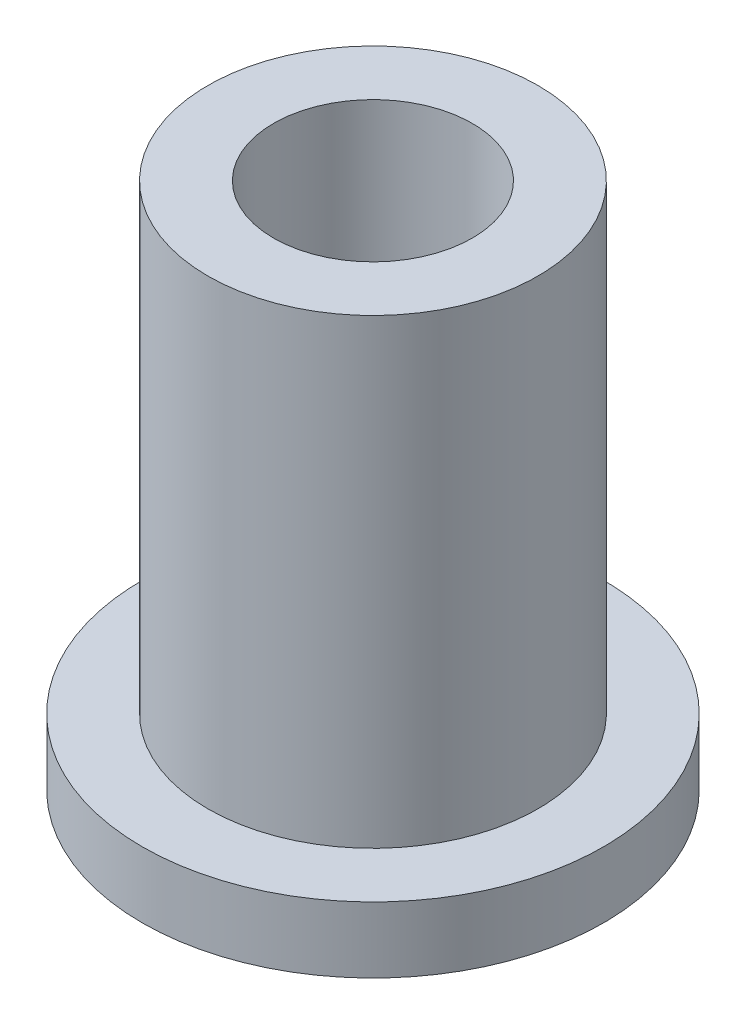
ISO-10303-21;
HEADER;
FILE_DESCRIPTION(('STEP AP214'),'2;1');
FILE_NAME('part.step','',(''),(''),'','','');
FILE_SCHEMA(('AUTOMOTIVE_DESIGN { 1 0 10303 214 1 1 1 1 }'));
ENDSEC;
DATA;
#1=APPLICATION_CONTEXT('core data for automotive mechanical design processes');
#2=APPLICATION_PROTOCOL_DEFINITION('international standard','automotive_design',2000,#1);
#3=PRODUCT_CONTEXT('',#1,'mechanical');
#4=PRODUCT('Part','Part','',(#3));
#5=PRODUCT_RELATED_PRODUCT_CATEGORY('part','',(#4));
#6=PRODUCT_DEFINITION_FORMATION('','',#4);
#7=PRODUCT_DEFINITION_CONTEXT('part definition',#1,'design');
#8=PRODUCT_DEFINITION('design','',#6,#7);
#9=PRODUCT_DEFINITION_SHAPE('','',#8);
#10=(LENGTH_UNIT() NAMED_UNIT(*) SI_UNIT(.MILLI.,.METRE.));
#11=(NAMED_UNIT(*) PLANE_ANGLE_UNIT() SI_UNIT($,.RADIAN.));
#12=(NAMED_UNIT(*) SI_UNIT($,.STERADIAN.) SOLID_ANGLE_UNIT());
#13=UNCERTAINTY_MEASURE_WITH_UNIT(LENGTH_MEASURE(1.E-05),#10,'distance_accuracy_value','');
#14=(GEOMETRIC_REPRESENTATION_CONTEXT(3) GLOBAL_UNCERTAINTY_ASSIGNED_CONTEXT((#13)) GLOBAL_UNIT_ASSIGNED_CONTEXT((#10,
#11,#12)) REPRESENTATION_CONTEXT('',''));
#15=CARTESIAN_POINT('',(0.,0.,0.));
#16=DIRECTION('',(0.,0.,1.));
#17=DIRECTION('',(1.,0.,0.));
#18=AXIS2_PLACEMENT_3D('',#15,#16,#17);
#19=CARTESIAN_POINT('',(0.,12.7,0.));
#20=DIRECTION('',(0.,1.,0.));
#21=DIRECTION('',(0.,0.,1.));
#22=AXIS2_PLACEMENT_3D('',#19,#20,#21);
#23=PLANE('',#22);
#24=CARTESIAN_POINT('',(0.,12.7,0.));
#25=DIRECTION('',(0.,1.,0.));
#26=DIRECTION('',(0.,0.,1.));
#27=AXIS2_PLACEMENT_3D('',#24,#25,#26);
#28=CIRCLE('',#27,3.9751);
#29=CARTESIAN_POINT('',(0.,12.7,3.9751));
#30=VERTEX_POINT('',#29);
#31=EDGE_CURVE('E10',#30,#30,#28,.T.);
#32=ORIENTED_EDGE('',*,*,#31,.T.);
#33=EDGE_LOOP('',(#32));
#34=FACE_BOUND('',#33,.T.);
#35=CARTESIAN_POINT('',(0.,12.7,0.));
#36=DIRECTION('',(0.,1.,0.));
#37=DIRECTION('',(0.,0.,1.));
#38=AXIS2_PLACEMENT_3D('',#35,#36,#37);
#39=CIRCLE('',#38,2.39395);
#40=CARTESIAN_POINT('',(0.,12.7,2.39395));
#41=VERTEX_POINT('',#40);
#42=EDGE_CURVE('E39',#41,#41,#39,.T.);
#43=ORIENTED_EDGE('',*,*,#42,.F.);
#44=EDGE_LOOP('',(#43));
#45=FACE_BOUND('',#44,.T.);
#46=ADVANCED_FACE('F32',(#34,#45),#23,.T.);
#47=CARTESIAN_POINT('',(0.,0.,0.));
#48=DIRECTION('',(0.,1.,0.));
#49=DIRECTION('',(0.,0.,1.));
#50=AXIS2_PLACEMENT_3D('',#47,#48,#49);
#51=PLANE('',#50);
#52=CARTESIAN_POINT('',(0.,0.,0.));
#53=DIRECTION('',(0.,1.,0.));
#54=DIRECTION('',(0.,0.,1.));
#55=AXIS2_PLACEMENT_3D('',#52,#53,#54);
#56=CIRCLE('',#55,2.39395);
#57=CARTESIAN_POINT('',(0.,0.,2.39395));
#58=VERTEX_POINT('',#57);
#59=EDGE_CURVE('E43',#58,#58,#56,.T.);
#60=ORIENTED_EDGE('',*,*,#59,.T.);
#61=EDGE_LOOP('',(#60));
#62=FACE_BOUND('',#61,.T.);
#63=CARTESIAN_POINT('',(0.,0.,0.));
#64=DIRECTION('',(0.,1.,0.));
#65=DIRECTION('',(0.,0.,1.));
#66=AXIS2_PLACEMENT_3D('',#63,#64,#65);
#67=CIRCLE('',#66,5.55625);
#68=CARTESIAN_POINT('',(0.,0.,5.55625));
#69=VERTEX_POINT('',#68);
#70=EDGE_CURVE('E50',#69,#69,#67,.T.);
#71=ORIENTED_EDGE('',*,*,#70,.F.);
#72=EDGE_LOOP('',(#71));
#73=FACE_BOUND('',#72,.T.);
#74=ADVANCED_FACE('F75',(#62,#73),#51,.F.);
#75=CARTESIAN_POINT('',(0.,12.7,0.));
#76=DIRECTION('',(0.,-1.,0.));
#77=DIRECTION('',(0.,0.,-1.));
#78=AXIS2_PLACEMENT_3D('',#75,#76,#77);
#79=CYLINDRICAL_SURFACE('',#78,3.9751);
#80=CARTESIAN_POINT('',(0.,1.5875,0.));
#81=DIRECTION('',(0.,1.,0.));
#82=DIRECTION('',(0.,0.,1.));
#83=AXIS2_PLACEMENT_3D('',#80,#81,#82);
#84=CIRCLE('',#83,3.9751);
#85=CARTESIAN_POINT('',(0.,1.5875,3.9751));
#86=VERTEX_POINT('',#85);
#87=EDGE_CURVE('E53',#86,#86,#84,.T.);
#88=ORIENTED_EDGE('',*,*,#87,.T.);
#89=EDGE_LOOP('',(#88));
#90=FACE_BOUND('',#89,.T.);
#91=ORIENTED_EDGE('',*,*,#31,.F.);
#92=EDGE_LOOP('',(#91));
#93=FACE_BOUND('',#92,.T.);
#94=ADVANCED_FACE('F34',(#90,#93),#79,.T.);
#95=CARTESIAN_POINT('',(0.,12.7,0.));
#96=DIRECTION('',(0.,-1.,0.));
#97=DIRECTION('',(0.,0.,-1.));
#98=AXIS2_PLACEMENT_3D('',#95,#96,#97);
#99=CYLINDRICAL_SURFACE('',#98,2.39395);
#100=ORIENTED_EDGE('',*,*,#42,.T.);
#101=EDGE_LOOP('',(#100));
#102=FACE_BOUND('',#101,.T.);
#103=ORIENTED_EDGE('',*,*,#59,.F.);
#104=EDGE_LOOP('',(#103));
#105=FACE_BOUND('',#104,.T.);
#106=ADVANCED_FACE('F64',(#102,#105),#99,.F.);
#107=CARTESIAN_POINT('',(0.,1.5875,0.));
#108=DIRECTION('',(0.,1.,0.));
#109=DIRECTION('',(0.,0.,1.));
#110=AXIS2_PLACEMENT_3D('',#107,#108,#109);
#111=PLANE('',#110);
#112=CARTESIAN_POINT('',(0.,1.5875,0.));
#113=DIRECTION('',(0.,1.,0.));
#114=DIRECTION('',(0.,0.,1.));
#115=AXIS2_PLACEMENT_3D('',#112,#113,#114);
#116=CIRCLE('',#115,5.55625);
#117=CARTESIAN_POINT('',(0.,1.5875,5.55625));
#118=VERTEX_POINT('',#117);
#119=EDGE_CURVE('E48',#118,#118,#116,.T.);
#120=ORIENTED_EDGE('',*,*,#119,.T.);
#121=EDGE_LOOP('',(#120));
#122=FACE_BOUND('',#121,.T.);
#123=ORIENTED_EDGE('',*,*,#87,.F.);
#124=EDGE_LOOP('',(#123));
#125=FACE_BOUND('',#124,.T.);
#126=ADVANCED_FACE('F61',(#122,#125),#111,.T.);
#127=CARTESIAN_POINT('',(0.,1.5875,0.));
#128=DIRECTION('',(0.,-1.,0.));
#129=DIRECTION('',(0.,0.,-1.));
#130=AXIS2_PLACEMENT_3D('',#127,#128,#129);
#131=CYLINDRICAL_SURFACE('',#130,5.55625);
#132=ORIENTED_EDGE('',*,*,#119,.F.);
#133=EDGE_LOOP('',(#132));
#134=FACE_BOUND('',#133,.T.);
#135=ORIENTED_EDGE('',*,*,#70,.T.);
#136=EDGE_LOOP('',(#135));
#137=FACE_BOUND('',#136,.T.);
#138=ADVANCED_FACE('F63',(#134,#137),#131,.T.);
#139=CLOSED_SHELL('',(#46,#74,#94,#106,#126,#138));
#140=MANIFOLD_SOLID_BREP('B2',#139);
#141=ADVANCED_BREP_SHAPE_REPRESENTATION('',(#18,#140),#14);
#142=SHAPE_DEFINITION_REPRESENTATION(#9,#141);
ENDSEC;
END-ISO-10303-21;
